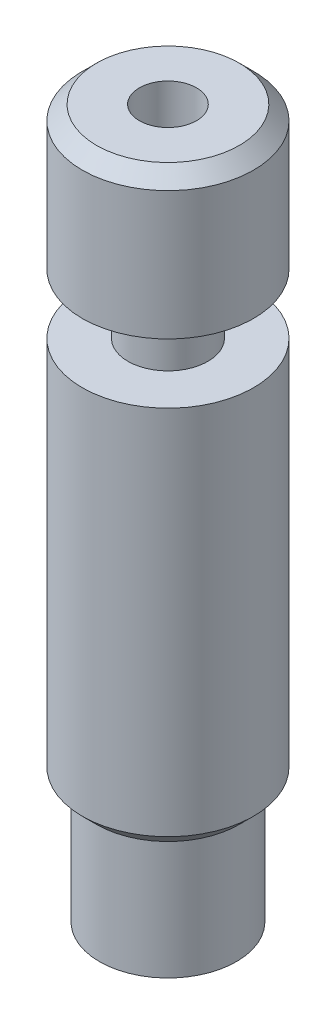
ISO-10303-21;
HEADER;
FILE_DESCRIPTION(('STEP AP214'),'2;1');
FILE_NAME('part.step','',(''),(''),'','','');
FILE_SCHEMA(('AUTOMOTIVE_DESIGN { 1 0 10303 214 1 1 1 1 }'));
ENDSEC;
DATA;
#1=APPLICATION_CONTEXT('core data for automotive mechanical design processes');
#2=APPLICATION_PROTOCOL_DEFINITION('international standard','automotive_design',2000,#1);
#3=PRODUCT_CONTEXT('',#1,'mechanical');
#4=PRODUCT('Part','Part','',(#3));
#5=PRODUCT_RELATED_PRODUCT_CATEGORY('part','',(#4));
#6=PRODUCT_DEFINITION_FORMATION('','',#4);
#7=PRODUCT_DEFINITION_CONTEXT('part definition',#1,'design');
#8=PRODUCT_DEFINITION('design','',#6,#7);
#9=PRODUCT_DEFINITION_SHAPE('','',#8);
#10=(LENGTH_UNIT() NAMED_UNIT(*) SI_UNIT(.MILLI.,.METRE.));
#11=(NAMED_UNIT(*) PLANE_ANGLE_UNIT() SI_UNIT($,.RADIAN.));
#12=(NAMED_UNIT(*) SI_UNIT($,.STERADIAN.) SOLID_ANGLE_UNIT());
#13=UNCERTAINTY_MEASURE_WITH_UNIT(LENGTH_MEASURE(1.E-05),#10,'distance_accuracy_value','');
#14=(GEOMETRIC_REPRESENTATION_CONTEXT(3) GLOBAL_UNCERTAINTY_ASSIGNED_CONTEXT((#13)) GLOBAL_UNIT_ASSIGNED_CONTEXT((#10,
#11,#12)) REPRESENTATION_CONTEXT('',''));
#15=CARTESIAN_POINT('',(0.,0.,0.));
#16=DIRECTION('',(0.,0.,1.));
#17=DIRECTION('',(1.,0.,0.));
#18=AXIS2_PLACEMENT_3D('',#15,#16,#17);
#19=CARTESIAN_POINT('',(1.,12.55,0.));
#20=DIRECTION('',(0.,-1.,0.));
#21=DIRECTION('',(0.,0.,-1.));
#22=AXIS2_PLACEMENT_3D('',#19,#20,#21);
#23=PLANE('',#22);
#24=CARTESIAN_POINT('',(0.,12.55,0.));
#25=DIRECTION('',(0.,1.,0.));
#26=DIRECTION('',(0.,0.,1.));
#27=AXIS2_PLACEMENT_3D('',#24,#25,#26);
#28=CIRCLE('',#27,0.999999999999997);
#29=CARTESIAN_POINT('',(0.,12.55,0.999999999999997));
#30=VERTEX_POINT('',#29);
#31=EDGE_CURVE('E76',#30,#30,#28,.T.);
#32=ORIENTED_EDGE('',*,*,#31,.F.);
#33=EDGE_LOOP('',(#32));
#34=FACE_BOUND('',#33,.T.);
#35=CARTESIAN_POINT('',(0.,12.55,0.));
#36=DIRECTION('',(0.,1.,0.));
#37=DIRECTION('',(0.,0.,1.));
#38=AXIS2_PLACEMENT_3D('',#35,#36,#37);
#39=CIRCLE('',#38,2.49999999999999);
#40=CARTESIAN_POINT('',(0.,12.55,2.49999999999999));
#41=VERTEX_POINT('',#40);
#42=EDGE_CURVE('E10',#41,#41,#39,.T.);
#43=ORIENTED_EDGE('',*,*,#42,.T.);
#44=EDGE_LOOP('',(#43));
#45=FACE_BOUND('',#44,.T.);
#46=ADVANCED_FACE('F30',(#34,#45),#23,.F.);
#47=CARTESIAN_POINT('',(0.,12.05,0.));
#48=DIRECTION('',(0.,-1.,0.));
#49=DIRECTION('',(0.,0.,-1.));
#50=AXIS2_PLACEMENT_3D('',#47,#48,#49);
#51=CONICAL_SURFACE('',#50,2.99999999999999,0.785398163397448);
#52=ORIENTED_EDGE('',*,*,#42,.F.);
#53=EDGE_LOOP('',(#52));
#54=FACE_BOUND('',#53,.T.);
#55=CARTESIAN_POINT('',(0.,12.05,0.));
#56=DIRECTION('',(0.,1.,0.));
#57=DIRECTION('',(0.,0.,1.));
#58=AXIS2_PLACEMENT_3D('',#55,#56,#57);
#59=CIRCLE('',#58,2.99999999999999);
#60=CARTESIAN_POINT('',(0.,12.05,2.99999999999999));
#61=VERTEX_POINT('',#60);
#62=EDGE_CURVE('E36',#61,#61,#59,.T.);
#63=ORIENTED_EDGE('',*,*,#62,.T.);
#64=EDGE_LOOP('',(#63));
#65=FACE_BOUND('',#64,.T.);
#66=ADVANCED_FACE('F83',(#54,#65),#51,.T.);
#67=CARTESIAN_POINT('',(0.,12.55,0.));
#68=DIRECTION('',(0.,1.,0.));
#69=DIRECTION('',(0.,0.,1.));
#70=AXIS2_PLACEMENT_3D('',#67,#68,#69);
#71=CYLINDRICAL_SURFACE('',#70,2.99999999999999);
#72=ORIENTED_EDGE('',*,*,#62,.F.);
#73=EDGE_LOOP('',(#72));
#74=FACE_BOUND('',#73,.T.);
#75=CARTESIAN_POINT('',(0.,7.55,0.));
#76=DIRECTION('',(0.,1.,0.));
#77=DIRECTION('',(0.,0.,1.));
#78=AXIS2_PLACEMENT_3D('',#75,#76,#77);
#79=CIRCLE('',#78,2.99999999999999);
#80=CARTESIAN_POINT('',(0.,7.55,2.99999999999999));
#81=VERTEX_POINT('',#80);
#82=EDGE_CURVE('E40',#81,#81,#79,.T.);
#83=ORIENTED_EDGE('',*,*,#82,.T.);
#84=EDGE_LOOP('',(#83));
#85=FACE_BOUND('',#84,.T.);
#86=ADVANCED_FACE('F87',(#74,#85),#71,.T.);
#87=CARTESIAN_POINT('',(3.,7.55,0.));
#88=DIRECTION('',(0.,1.,0.));
#89=DIRECTION('',(0.,0.,1.));
#90=AXIS2_PLACEMENT_3D('',#87,#88,#89);
#91=PLANE('',#90);
#92=ORIENTED_EDGE('',*,*,#82,.F.);
#93=EDGE_LOOP('',(#92));
#94=FACE_BOUND('',#93,.T.);
#95=CARTESIAN_POINT('',(0.,7.55,0.));
#96=DIRECTION('',(0.,1.,0.));
#97=DIRECTION('',(0.,0.,1.));
#98=AXIS2_PLACEMENT_3D('',#95,#96,#97);
#99=CIRCLE('',#98,1.4);
#100=CARTESIAN_POINT('',(0.,7.55,1.4));
#101=VERTEX_POINT('',#100);
#102=EDGE_CURVE('E44',#101,#101,#99,.T.);
#103=ORIENTED_EDGE('',*,*,#102,.T.);
#104=EDGE_LOOP('',(#103));
#105=FACE_BOUND('',#104,.T.);
#106=ADVANCED_FACE('F92',(#94,#105),#91,.F.);
#107=CARTESIAN_POINT('',(0.,12.55,0.));
#108=DIRECTION('',(0.,1.,0.));
#109=DIRECTION('',(0.,0.,1.));
#110=AXIS2_PLACEMENT_3D('',#107,#108,#109);
#111=CYLINDRICAL_SURFACE('',#110,1.4);
#112=ORIENTED_EDGE('',*,*,#102,.F.);
#113=EDGE_LOOP('',(#112));
#114=FACE_BOUND('',#113,.T.);
#115=CARTESIAN_POINT('',(0.,5.45,0.));
#116=DIRECTION('',(0.,1.,0.));
#117=DIRECTION('',(0.,0.,1.));
#118=AXIS2_PLACEMENT_3D('',#115,#116,#117);
#119=CIRCLE('',#118,1.4);
#120=CARTESIAN_POINT('',(0.,5.45,1.4));
#121=VERTEX_POINT('',#120);
#122=EDGE_CURVE('E49',#121,#121,#119,.T.);
#123=ORIENTED_EDGE('',*,*,#122,.T.);
#124=EDGE_LOOP('',(#123));
#125=FACE_BOUND('',#124,.T.);
#126=ADVANCED_FACE('F98',(#114,#125),#111,.T.);
#127=CARTESIAN_POINT('',(1.4,5.45,0.));
#128=DIRECTION('',(0.,-1.,0.));
#129=DIRECTION('',(0.,0.,-1.));
#130=AXIS2_PLACEMENT_3D('',#127,#128,#129);
#131=PLANE('',#130);
#132=ORIENTED_EDGE('',*,*,#122,.F.);
#133=EDGE_LOOP('',(#132));
#134=FACE_BOUND('',#133,.T.);
#135=CARTESIAN_POINT('',(0.,5.45,0.));
#136=DIRECTION('',(0.,1.,0.));
#137=DIRECTION('',(0.,0.,1.));
#138=AXIS2_PLACEMENT_3D('',#135,#136,#137);
#139=CIRCLE('',#138,3.);
#140=CARTESIAN_POINT('',(0.,5.45,3.));
#141=VERTEX_POINT('',#140);
#142=EDGE_CURVE('E52',#141,#141,#139,.T.);
#143=ORIENTED_EDGE('',*,*,#142,.T.);
#144=EDGE_LOOP('',(#143));
#145=FACE_BOUND('',#144,.T.);
#146=ADVANCED_FACE('F102',(#134,#145),#131,.F.);
#147=CARTESIAN_POINT('',(0.,12.55,0.));
#148=DIRECTION('',(0.,1.,0.));
#149=DIRECTION('',(0.,0.,1.));
#150=AXIS2_PLACEMENT_3D('',#147,#148,#149);
#151=CYLINDRICAL_SURFACE('',#150,3.);
#152=ORIENTED_EDGE('',*,*,#142,.F.);
#153=EDGE_LOOP('',(#152));
#154=FACE_BOUND('',#153,.T.);
#155=CARTESIAN_POINT('',(0.,-7.55,0.));
#156=DIRECTION('',(0.,1.,0.));
#157=DIRECTION('',(0.,0.,1.));
#158=AXIS2_PLACEMENT_3D('',#155,#156,#157);
#159=CIRCLE('',#158,3.);
#160=CARTESIAN_POINT('',(0.,-7.55,3.));
#161=VERTEX_POINT('',#160);
#162=EDGE_CURVE('E55',#161,#161,#159,.T.);
#163=ORIENTED_EDGE('',*,*,#162,.T.);
#164=EDGE_LOOP('',(#163));
#165=FACE_BOUND('',#164,.T.);
#166=ADVANCED_FACE('F106',(#154,#165),#151,.T.);
#167=CARTESIAN_POINT('',(0.,-8.05,0.));
#168=DIRECTION('',(0.,1.,0.));
#169=DIRECTION('',(0.,0.,1.));
#170=AXIS2_PLACEMENT_3D('',#167,#168,#169);
#171=CONICAL_SURFACE('',#170,2.5,0.785398163397448);
#172=ORIENTED_EDGE('',*,*,#162,.F.);
#173=EDGE_LOOP('',(#172));
#174=FACE_BOUND('',#173,.T.);
#175=CARTESIAN_POINT('',(0.,-8.05,0.));
#176=DIRECTION('',(0.,1.,0.));
#177=DIRECTION('',(0.,0.,1.));
#178=AXIS2_PLACEMENT_3D('',#175,#176,#177);
#179=CIRCLE('',#178,2.5);
#180=CARTESIAN_POINT('',(0.,-8.05,2.5));
#181=VERTEX_POINT('',#180);
#182=EDGE_CURVE('E58',#181,#181,#179,.T.);
#183=ORIENTED_EDGE('',*,*,#182,.T.);
#184=EDGE_LOOP('',(#183));
#185=FACE_BOUND('',#184,.T.);
#186=ADVANCED_FACE('F110',(#174,#185),#171,.T.);
#187=CARTESIAN_POINT('',(2.4,-8.05,0.));
#188=DIRECTION('',(0.,1.,0.));
#189=DIRECTION('',(0.,0.,1.));
#190=AXIS2_PLACEMENT_3D('',#187,#188,#189);
#191=PLANE('',#190);
#192=ORIENTED_EDGE('',*,*,#182,.F.);
#193=EDGE_LOOP('',(#192));
#194=FACE_BOUND('',#193,.T.);
#195=CARTESIAN_POINT('',(0.,-8.05,0.));
#196=DIRECTION('',(0.,1.,0.));
#197=DIRECTION('',(0.,0.,1.));
#198=AXIS2_PLACEMENT_3D('',#195,#196,#197);
#199=CIRCLE('',#198,2.4);
#200=CARTESIAN_POINT('',(0.,-8.05,2.4));
#201=VERTEX_POINT('',#200);
#202=EDGE_CURVE('E61',#201,#201,#199,.T.);
#203=ORIENTED_EDGE('',*,*,#202,.T.);
#204=EDGE_LOOP('',(#203));
#205=FACE_BOUND('',#204,.T.);
#206=ADVANCED_FACE('F114',(#194,#205),#191,.F.);
#207=CARTESIAN_POINT('',(0.,12.55,0.));
#208=DIRECTION('',(0.,1.,0.));
#209=DIRECTION('',(0.,0.,1.));
#210=AXIS2_PLACEMENT_3D('',#207,#208,#209);
#211=CYLINDRICAL_SURFACE('',#210,2.4);
#212=ORIENTED_EDGE('',*,*,#202,.F.);
#213=EDGE_LOOP('',(#212));
#214=FACE_BOUND('',#213,.T.);
#215=CARTESIAN_POINT('',(0.,-12.2613248654052,0.));
#216=DIRECTION('',(0.,1.,0.));
#217=DIRECTION('',(0.,0.,1.));
#218=AXIS2_PLACEMENT_3D('',#215,#216,#217);
#219=CIRCLE('',#218,2.4);
#220=CARTESIAN_POINT('',(0.,-12.2613248654052,2.4));
#221=VERTEX_POINT('',#220);
#222=EDGE_CURVE('E64',#221,#221,#219,.T.);
#223=ORIENTED_EDGE('',*,*,#222,.T.);
#224=EDGE_LOOP('',(#223));
#225=FACE_BOUND('',#224,.T.);
#226=ADVANCED_FACE('F118',(#214,#225),#211,.T.);
#227=CARTESIAN_POINT('',(0.,-12.55,0.));
#228=DIRECTION('',(0.,1.,0.));
#229=DIRECTION('',(0.,0.,1.));
#230=AXIS2_PLACEMENT_3D('',#227,#228,#229);
#231=CONICAL_SURFACE('',#230,1.9,1.0471975511966);
#232=ORIENTED_EDGE('',*,*,#222,.F.);
#233=EDGE_LOOP('',(#232));
#234=FACE_BOUND('',#233,.T.);
#235=CARTESIAN_POINT('',(0.,-12.55,0.));
#236=DIRECTION('',(0.,1.,0.));
#237=DIRECTION('',(0.,0.,1.));
#238=AXIS2_PLACEMENT_3D('',#235,#236,#237);
#239=CIRCLE('',#238,1.9);
#240=CARTESIAN_POINT('',(0.,-12.55,1.9));
#241=VERTEX_POINT('',#240);
#242=EDGE_CURVE('E67',#241,#241,#239,.T.);
#243=ORIENTED_EDGE('',*,*,#242,.T.);
#244=EDGE_LOOP('',(#243));
#245=FACE_BOUND('',#244,.T.);
#246=ADVANCED_FACE('F122',(#234,#245),#231,.T.);
#247=CARTESIAN_POINT('',(1.4,-12.55,0.));
#248=DIRECTION('',(0.,1.,0.));
#249=DIRECTION('',(0.,0.,1.));
#250=AXIS2_PLACEMENT_3D('',#247,#248,#249);
#251=PLANE('',#250);
#252=ORIENTED_EDGE('',*,*,#242,.F.);
#253=EDGE_LOOP('',(#252));
#254=FACE_BOUND('',#253,.T.);
#255=CARTESIAN_POINT('',(0.,-12.55,0.));
#256=DIRECTION('',(0.,1.,0.));
#257=DIRECTION('',(0.,0.,1.));
#258=AXIS2_PLACEMENT_3D('',#255,#256,#257);
#259=CIRCLE('',#258,1.4);
#260=CARTESIAN_POINT('',(0.,-12.55,1.4));
#261=VERTEX_POINT('',#260);
#262=EDGE_CURVE('E70',#261,#261,#259,.T.);
#263=ORIENTED_EDGE('',*,*,#262,.T.);
#264=EDGE_LOOP('',(#263));
#265=FACE_BOUND('',#264,.T.);
#266=ADVANCED_FACE('F126',(#254,#265),#251,.F.);
#267=CARTESIAN_POINT('',(0.,-12.15,0.));
#268=DIRECTION('',(0.,-1.,0.));
#269=DIRECTION('',(0.,0.,-1.));
#270=AXIS2_PLACEMENT_3D('',#267,#268,#269);
#271=CONICAL_SURFACE('',#270,0.999999999999997,0.785398163397451);
#272=ORIENTED_EDGE('',*,*,#262,.F.);
#273=EDGE_LOOP('',(#272));
#274=FACE_BOUND('',#273,.T.);
#275=CARTESIAN_POINT('',(0.,-12.15,0.));
#276=DIRECTION('',(0.,1.,0.));
#277=DIRECTION('',(0.,0.,1.));
#278=AXIS2_PLACEMENT_3D('',#275,#276,#277);
#279=CIRCLE('',#278,0.999999999999997);
#280=CARTESIAN_POINT('',(0.,-12.15,0.999999999999997));
#281=VERTEX_POINT('',#280);
#282=EDGE_CURVE('E73',#281,#281,#279,.T.);
#283=ORIENTED_EDGE('',*,*,#282,.T.);
#284=EDGE_LOOP('',(#283));
#285=FACE_BOUND('',#284,.T.);
#286=ADVANCED_FACE('F130',(#274,#285),#271,.F.);
#287=CARTESIAN_POINT('',(0.,12.55,0.));
#288=DIRECTION('',(0.,1.,0.));
#289=DIRECTION('',(0.,0.,1.));
#290=AXIS2_PLACEMENT_3D('',#287,#288,#289);
#291=CYLINDRICAL_SURFACE('',#290,0.999999999999997);
#292=ORIENTED_EDGE('',*,*,#282,.F.);
#293=EDGE_LOOP('',(#292));
#294=FACE_BOUND('',#293,.T.);
#295=ORIENTED_EDGE('',*,*,#31,.T.);
#296=EDGE_LOOP('',(#295));
#297=FACE_BOUND('',#296,.T.);
#298=ADVANCED_FACE('F80',(#294,#297),#291,.F.);
#299=CLOSED_SHELL('',(#46,#66,#86,#106,#126,#146,#166,#186,#206,#226,#246,#266,#286,#298));
#300=MANIFOLD_SOLID_BREP('B2',#299);
#301=ADVANCED_BREP_SHAPE_REPRESENTATION('',(#18,#300),#14);
#302=SHAPE_DEFINITION_REPRESENTATION(#9,#301);
ENDSEC;
END-ISO-10303-21;
